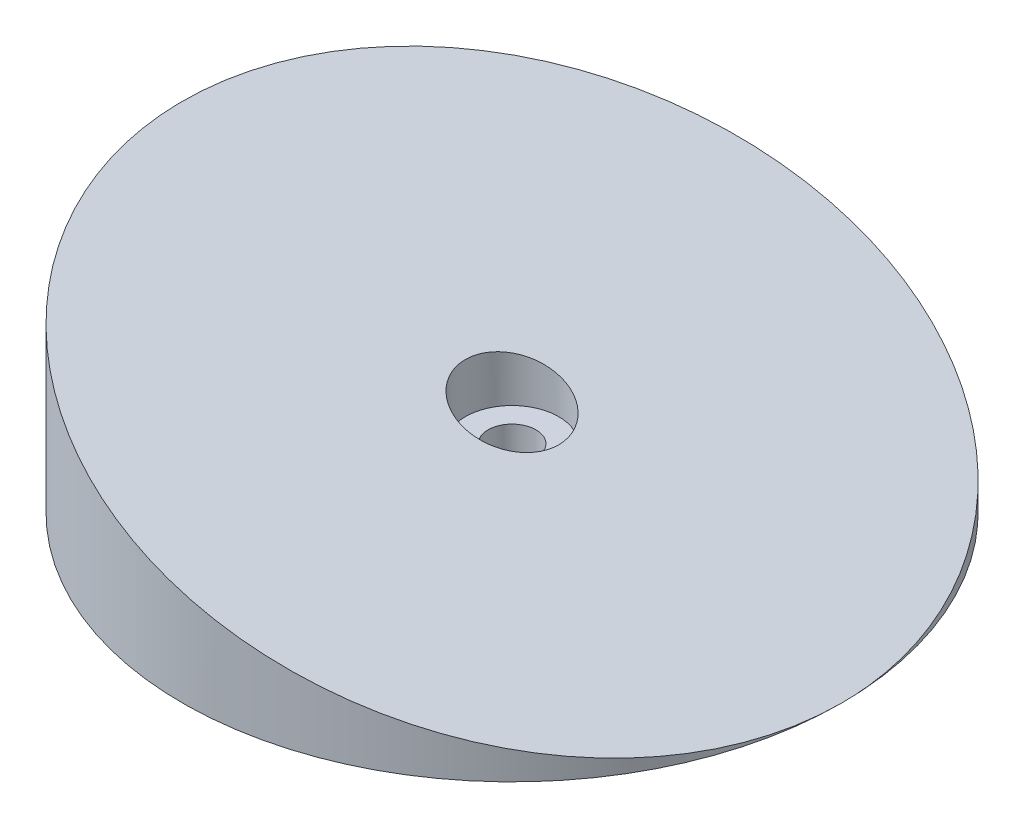
ISO-10303-21;
HEADER;
FILE_DESCRIPTION(('STEP AP214'),'2;1');
FILE_NAME('part.step','',(''),(''),'','','');
FILE_SCHEMA(('AUTOMOTIVE_DESIGN { 1 0 10303 214 1 1 1 1 }'));
ENDSEC;
DATA;
#1=APPLICATION_CONTEXT('core data for automotive mechanical design processes');
#2=APPLICATION_PROTOCOL_DEFINITION('international standard','automotive_design',2000,#1);
#3=PRODUCT_CONTEXT('',#1,'mechanical');
#4=PRODUCT('Part','Part','',(#3));
#5=PRODUCT_RELATED_PRODUCT_CATEGORY('part','',(#4));
#6=PRODUCT_DEFINITION_FORMATION('','',#4);
#7=PRODUCT_DEFINITION_CONTEXT('part definition',#1,'design');
#8=PRODUCT_DEFINITION('design','',#6,#7);
#9=PRODUCT_DEFINITION_SHAPE('','',#8);
#10=(LENGTH_UNIT() NAMED_UNIT(*) SI_UNIT(.MILLI.,.METRE.));
#11=(NAMED_UNIT(*) PLANE_ANGLE_UNIT() SI_UNIT($,.RADIAN.));
#12=(NAMED_UNIT(*) SI_UNIT($,.STERADIAN.) SOLID_ANGLE_UNIT());
#13=UNCERTAINTY_MEASURE_WITH_UNIT(LENGTH_MEASURE(1.E-05),#10,'distance_accuracy_value','');
#14=(GEOMETRIC_REPRESENTATION_CONTEXT(3) GLOBAL_UNCERTAINTY_ASSIGNED_CONTEXT((#13)) GLOBAL_UNIT_ASSIGNED_CONTEXT((#10,
#11,#12)) REPRESENTATION_CONTEXT('',''));
#15=CARTESIAN_POINT('',(0.,0.,0.));
#16=DIRECTION('',(0.,0.,1.));
#17=DIRECTION('',(1.,0.,0.));
#18=AXIS2_PLACEMENT_3D('',#15,#16,#17);
#19=CARTESIAN_POINT('',(0.,32.,0.));
#20=DIRECTION('',(0.,-1.,0.));
#21=DIRECTION('',(0.,0.,-1.));
#22=AXIS2_PLACEMENT_3D('',#19,#20,#21);
#23=CYLINDRICAL_SURFACE('',#22,4.);
#24=CARTESIAN_POINT('',(0.,0.,0.));
#25=DIRECTION('',(0.,1.,0.));
#26=DIRECTION('',(0.,0.,1.));
#27=AXIS2_PLACEMENT_3D('',#24,#25,#26);
#28=CIRCLE('',#27,4.);
#29=CARTESIAN_POINT('',(0.,0.,4.));
#30=VERTEX_POINT('',#29);
#31=EDGE_CURVE('E45',#30,#30,#28,.T.);
#32=ORIENTED_EDGE('',*,*,#31,.F.);
#33=EDGE_LOOP('',(#32));
#34=FACE_BOUND('',#33,.T.);
#35=CARTESIAN_POINT('',(0.,10.,0.));
#36=DIRECTION('',(0.,1.,0.));
#37=DIRECTION('',(0.,0.,1.));
#38=AXIS2_PLACEMENT_3D('',#35,#36,#37);
#39=CIRCLE('',#38,4.);
#40=CARTESIAN_POINT('',(0.,10.,4.));
#41=VERTEX_POINT('',#40);
#42=EDGE_CURVE('E41',#41,#41,#39,.T.);
#43=ORIENTED_EDGE('',*,*,#42,.T.);
#44=EDGE_LOOP('',(#43));
#45=FACE_BOUND('',#44,.T.);
#46=ADVANCED_FACE('F37',(#34,#45),#23,.F.);
#47=CARTESIAN_POINT('',(0.,32.,0.));
#48=DIRECTION('',(0.,-1.,0.));
#49=DIRECTION('',(0.,0.,-1.));
#50=AXIS2_PLACEMENT_3D('',#47,#48,#49);
#51=CYLINDRICAL_SURFACE('',#50,55.);
#52=CARTESIAN_POINT('',(0.,0.,0.));
#53=DIRECTION('',(0.,1.,0.));
#54=DIRECTION('',(0.,0.,1.));
#55=AXIS2_PLACEMENT_3D('',#52,#53,#54);
#56=CIRCLE('',#55,55.);
#57=CARTESIAN_POINT('',(55.,0.,0.));
#58=VERTEX_POINT('',#57);
#59=EDGE_CURVE('E11',#58,#58,#56,.T.);
#60=ORIENTED_EDGE('',*,*,#59,.T.);
#61=CARTESIAN_POINT('',(0.,16.,0.));
#62=DIRECTION('',(-0.279329540830131,-0.960195296603575,0.));
#63=DIRECTION('',(0.960195296603575,-0.279329540830131,0.));
#64=AXIS2_PLACEMENT_3D('',#61,#62,#63);
#65=ELLIPSE('',#64,57.2800139664787,55.);
#66=EDGE_CURVE('E50',#58,#58,#65,.T.);
#67=ORIENTED_EDGE('',*,*,#66,.T.);
#68=EDGE_LOOP('',(#60,#67));
#69=FACE_BOUND('',#68,.T.);
#70=ADVANCED_FACE('F39',(#69),#51,.T.);
#71=CARTESIAN_POINT('',(0.,0.,0.));
#72=DIRECTION('',(0.,1.,0.));
#73=DIRECTION('',(0.,0.,1.));
#74=AXIS2_PLACEMENT_3D('',#71,#72,#73);
#75=PLANE('',#74);
#76=ORIENTED_EDGE('',*,*,#59,.F.);
#77=EDGE_LOOP('',(#76));
#78=FACE_BOUND('',#77,.T.);
#79=ORIENTED_EDGE('',*,*,#31,.T.);
#80=EDGE_LOOP('',(#79));
#81=FACE_BOUND('',#80,.T.);
#82=ADVANCED_FACE('F77',(#78,#81),#75,.F.);
#83=CARTESIAN_POINT('',(-55.,32.,-55.));
#84=DIRECTION('',(-0.279329540830131,-0.960195296603575,0.));
#85=DIRECTION('',(0.960195296603575,-0.279329540830131,0.));
#86=AXIS2_PLACEMENT_3D('',#83,#84,#85);
#87=PLANE('',#86);
#88=CARTESIAN_POINT('',(0.,16.,0.));
#89=DIRECTION('',(-0.279329540830131,-0.960195296603575,0.));
#90=DIRECTION('',(0.960195296603575,-0.279329540830131,0.));
#91=AXIS2_PLACEMENT_3D('',#88,#89,#90);
#92=ELLIPSE('',#91,8.11982429878378,7.79661710093961);
#93=CARTESIAN_POINT('',(7.79661710093961,13.7318932069994,0.));
#94=VERTEX_POINT('',#93);
#95=EDGE_CURVE('E57',#94,#94,#92,.F.);
#96=ORIENTED_EDGE('',*,*,#95,.F.);
#97=EDGE_LOOP('',(#96));
#98=FACE_BOUND('',#97,.T.);
#99=ORIENTED_EDGE('',*,*,#66,.F.);
#100=EDGE_LOOP('',(#99));
#101=FACE_BOUND('',#100,.T.);
#102=ADVANCED_FACE('F51',(#98,#101),#87,.F.);
#103=CARTESIAN_POINT('',(0.,32.,0.));
#104=DIRECTION('',(0.,-1.,0.));
#105=DIRECTION('',(0.,0.,-1.));
#106=AXIS2_PLACEMENT_3D('',#103,#104,#105);
#107=CYLINDRICAL_SURFACE('',#106,7.79661710093961);
#108=CARTESIAN_POINT('',(0.,10.,0.));
#109=DIRECTION('',(0.,1.,0.));
#110=DIRECTION('',(0.,0.,1.));
#111=AXIS2_PLACEMENT_3D('',#108,#109,#110);
#112=CIRCLE('',#111,7.79661710093961);
#113=CARTESIAN_POINT('',(0.,10.,7.79661710093961));
#114=VERTEX_POINT('',#113);
#115=EDGE_CURVE('E59',#114,#114,#112,.T.);
#116=ORIENTED_EDGE('',*,*,#115,.F.);
#117=EDGE_LOOP('',(#116));
#118=FACE_BOUND('',#117,.T.);
#119=ORIENTED_EDGE('',*,*,#95,.T.);
#120=EDGE_LOOP('',(#119));
#121=FACE_BOUND('',#120,.T.);
#122=ADVANCED_FACE('F68',(#118,#121),#107,.F.);
#123=CARTESIAN_POINT('',(0.,10.,0.));
#124=DIRECTION('',(0.,1.,0.));
#125=DIRECTION('',(0.,0.,1.));
#126=AXIS2_PLACEMENT_3D('',#123,#124,#125);
#127=PLANE('',#126);
#128=ORIENTED_EDGE('',*,*,#42,.F.);
#129=EDGE_LOOP('',(#128));
#130=FACE_BOUND('',#129,.T.);
#131=ORIENTED_EDGE('',*,*,#115,.T.);
#132=EDGE_LOOP('',(#131));
#133=FACE_BOUND('',#132,.T.);
#134=ADVANCED_FACE('F66',(#130,#133),#127,.T.);
#135=CLOSED_SHELL('',(#46,#70,#82,#102,#122,#134));
#136=MANIFOLD_SOLID_BREP('B2',#135);
#137=ADVANCED_BREP_SHAPE_REPRESENTATION('',(#18,#136),#14);
#138=SHAPE_DEFINITION_REPRESENTATION(#9,#137);
ENDSEC;
END-ISO-10303-21;
